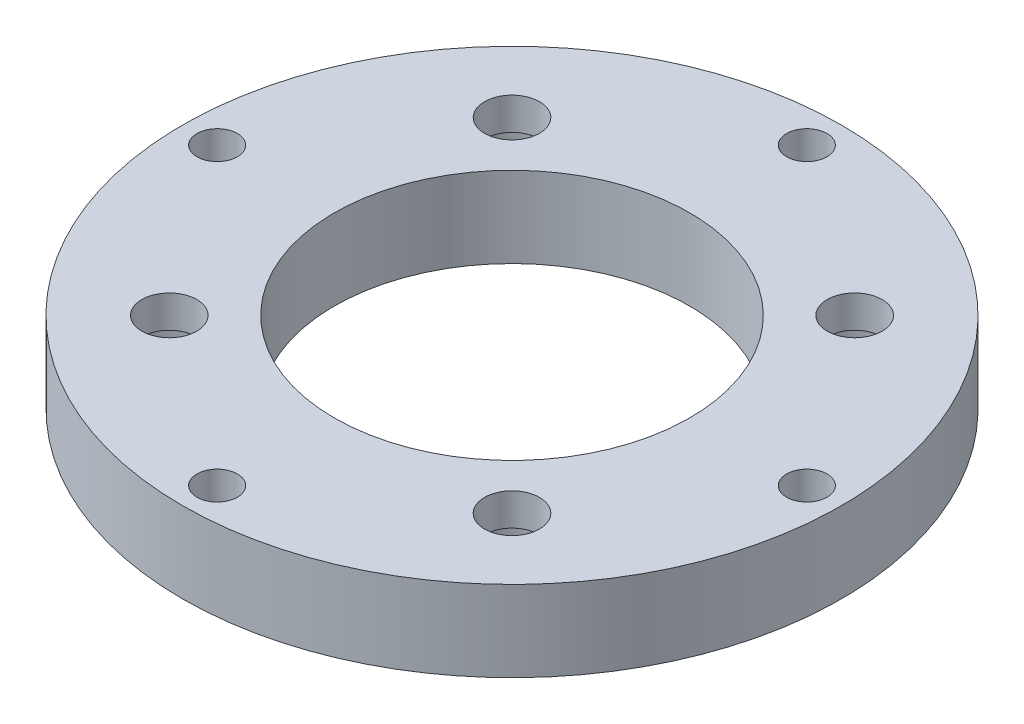
ISO-10303-21;
HEADER;
FILE_DESCRIPTION(('STEP AP214'),'2;1');
FILE_NAME('part.step','',(''),(''),'','','');
FILE_SCHEMA(('AUTOMOTIVE_DESIGN { 1 0 10303 214 1 1 1 1 }'));
ENDSEC;
DATA;
#1=APPLICATION_CONTEXT('core data for automotive mechanical design processes');
#2=APPLICATION_PROTOCOL_DEFINITION('international standard','automotive_design',2000,#1);
#3=PRODUCT_CONTEXT('',#1,'mechanical');
#4=PRODUCT('Part','Part','',(#3));
#5=PRODUCT_RELATED_PRODUCT_CATEGORY('part','',(#4));
#6=PRODUCT_DEFINITION_FORMATION('','',#4);
#7=PRODUCT_DEFINITION_CONTEXT('part definition',#1,'design');
#8=PRODUCT_DEFINITION('design','',#6,#7);
#9=PRODUCT_DEFINITION_SHAPE('','',#8);
#10=(LENGTH_UNIT() NAMED_UNIT(*) SI_UNIT(.MILLI.,.METRE.));
#11=(NAMED_UNIT(*) PLANE_ANGLE_UNIT() SI_UNIT($,.RADIAN.));
#12=(NAMED_UNIT(*) SI_UNIT($,.STERADIAN.) SOLID_ANGLE_UNIT());
#13=UNCERTAINTY_MEASURE_WITH_UNIT(LENGTH_MEASURE(1.E-05),#10,'distance_accuracy_value','');
#14=(GEOMETRIC_REPRESENTATION_CONTEXT(3) GLOBAL_UNCERTAINTY_ASSIGNED_CONTEXT((#13)) GLOBAL_UNIT_ASSIGNED_CONTEXT((#10,
#11,#12)) REPRESENTATION_CONTEXT('',''));
#15=CARTESIAN_POINT('',(0.,0.,0.));
#16=DIRECTION('',(0.,0.,1.));
#17=DIRECTION('',(1.,0.,0.));
#18=AXIS2_PLACEMENT_3D('',#15,#16,#17);
#19=CARTESIAN_POINT('',(0.,5.,0.));
#20=DIRECTION('',(0.,1.,0.));
#21=DIRECTION('',(0.,0.,1.));
#22=AXIS2_PLACEMENT_3D('',#19,#20,#21);
#23=PLANE('',#22);
#24=CARTESIAN_POINT('',(-10.6066017177982,5.,10.6066017177982));
#25=DIRECTION('',(0.,-1.,0.));
#26=DIRECTION('',(0.,0.,-1.));
#27=AXIS2_PLACEMENT_3D('',#24,#25,#26);
#28=CIRCLE('',#27,1.70000000000001);
#29=CARTESIAN_POINT('',(-10.6066017177982,5.,8.90660171779822));
#30=VERTEX_POINT('',#29);
#31=EDGE_CURVE('E114',#30,#30,#28,.T.);
#32=ORIENTED_EDGE('',*,*,#31,.T.);
#33=EDGE_LOOP('',(#32));
#34=FACE_BOUND('',#33,.T.);
#35=CARTESIAN_POINT('',(10.6066017177983,5.,10.6066017177982));
#36=DIRECTION('',(0.,-1.,0.));
#37=DIRECTION('',(0.,0.,-1.));
#38=AXIS2_PLACEMENT_3D('',#35,#36,#37);
#39=CIRCLE('',#38,1.70000000000001);
#40=CARTESIAN_POINT('',(10.6066017177983,5.,8.90660171779815));
#41=VERTEX_POINT('',#40);
#42=EDGE_CURVE('E102',#41,#41,#39,.T.);
#43=ORIENTED_EDGE('',*,*,#42,.T.);
#44=EDGE_LOOP('',(#43));
#45=FACE_BOUND('',#44,.T.);
#46=CARTESIAN_POINT('',(10.6066017177982,5.,-10.6066017177982));
#47=DIRECTION('',(0.,-1.,0.));
#48=DIRECTION('',(0.,0.,-1.));
#49=AXIS2_PLACEMENT_3D('',#46,#47,#48);
#50=CIRCLE('',#49,1.70000000000001);
#51=CARTESIAN_POINT('',(10.6066017177982,5.,-12.3066017177982));
#52=VERTEX_POINT('',#51);
#53=EDGE_CURVE('E90',#52,#52,#50,.T.);
#54=ORIENTED_EDGE('',*,*,#53,.T.);
#55=EDGE_LOOP('',(#54));
#56=FACE_BOUND('',#55,.T.);
#57=CARTESIAN_POINT('',(-10.6066017177983,5.,-10.6066017177981));
#58=DIRECTION('',(0.,-1.,0.));
#59=DIRECTION('',(0.,0.,-1.));
#60=AXIS2_PLACEMENT_3D('',#57,#58,#59);
#61=CIRCLE('',#60,1.70000000000001);
#62=CARTESIAN_POINT('',(-10.6066017177983,5.,-12.3066017177981));
#63=VERTEX_POINT('',#62);
#64=EDGE_CURVE('E78',#63,#63,#61,.T.);
#65=ORIENTED_EDGE('',*,*,#64,.T.);
#66=EDGE_LOOP('',(#65));
#67=FACE_BOUND('',#66,.T.);
#68=CARTESIAN_POINT('',(-18.25,5.,0.));
#69=DIRECTION('',(0.,1.,0.));
#70=DIRECTION('',(0.,0.,1.));
#71=AXIS2_PLACEMENT_3D('',#68,#69,#70);
#72=CIRCLE('',#71,1.24999999999999);
#73=CARTESIAN_POINT('',(-18.25,5.,1.24999999999999));
#74=VERTEX_POINT('',#73);
#75=EDGE_CURVE('E75',#74,#74,#72,.T.);
#76=ORIENTED_EDGE('',*,*,#75,.F.);
#77=EDGE_LOOP('',(#76));
#78=FACE_BOUND('',#77,.T.);
#79=CARTESIAN_POINT('',(0.,5.,-18.25));
#80=DIRECTION('',(0.,1.,0.));
#81=DIRECTION('',(0.,0.,1.));
#82=AXIS2_PLACEMENT_3D('',#79,#80,#81);
#83=CIRCLE('',#82,1.24999999999999);
#84=CARTESIAN_POINT('',(0.,5.,-17.));
#85=VERTEX_POINT('',#84);
#86=EDGE_CURVE('E69',#85,#85,#83,.T.);
#87=ORIENTED_EDGE('',*,*,#86,.F.);
#88=EDGE_LOOP('',(#87));
#89=FACE_BOUND('',#88,.T.);
#90=CARTESIAN_POINT('',(18.25,5.,0.));
#91=DIRECTION('',(0.,1.,0.));
#92=DIRECTION('',(0.,0.,1.));
#93=AXIS2_PLACEMENT_3D('',#90,#91,#92);
#94=CIRCLE('',#93,1.24999999999999);
#95=CARTESIAN_POINT('',(18.25,5.,1.24999999999999));
#96=VERTEX_POINT('',#95);
#97=EDGE_CURVE('E63',#96,#96,#94,.T.);
#98=ORIENTED_EDGE('',*,*,#97,.F.);
#99=EDGE_LOOP('',(#98));
#100=FACE_BOUND('',#99,.T.);
#101=CARTESIAN_POINT('',(0.,5.,18.25));
#102=DIRECTION('',(0.,1.,0.));
#103=DIRECTION('',(0.,0.,1.));
#104=AXIS2_PLACEMENT_3D('',#101,#102,#103);
#105=CIRCLE('',#104,1.24999999999999);
#106=CARTESIAN_POINT('',(0.,5.,19.5));
#107=VERTEX_POINT('',#106);
#108=EDGE_CURVE('E57',#107,#107,#105,.T.);
#109=ORIENTED_EDGE('',*,*,#108,.F.);
#110=EDGE_LOOP('',(#109));
#111=FACE_BOUND('',#110,.T.);
#112=CARTESIAN_POINT('',(0.,5.,0.));
#113=DIRECTION('',(0.,1.,0.));
#114=DIRECTION('',(0.,0.,1.));
#115=AXIS2_PLACEMENT_3D('',#112,#113,#114);
#116=CIRCLE('',#115,20.4);
#117=CARTESIAN_POINT('',(0.,5.,20.4));
#118=VERTEX_POINT('',#117);
#119=EDGE_CURVE('E10',#118,#118,#116,.T.);
#120=ORIENTED_EDGE('',*,*,#119,.T.);
#121=EDGE_LOOP('',(#120));
#122=FACE_BOUND('',#121,.T.);
#123=CARTESIAN_POINT('',(0.,5.,0.));
#124=DIRECTION('',(0.,1.,0.));
#125=DIRECTION('',(0.,0.,1.));
#126=AXIS2_PLACEMENT_3D('',#123,#124,#125);
#127=CIRCLE('',#126,11.);
#128=CARTESIAN_POINT('',(0.,5.,11.));
#129=VERTEX_POINT('',#128);
#130=EDGE_CURVE('E47',#129,#129,#127,.T.);
#131=ORIENTED_EDGE('',*,*,#130,.F.);
#132=EDGE_LOOP('',(#131));
#133=FACE_BOUND('',#132,.T.);
#134=ADVANCED_FACE('F36',(#34,#45,#56,#67,#78,#89,#100,#111,#122,#133),#23,.T.);
#135=CARTESIAN_POINT('',(0.,0.,0.));
#136=DIRECTION('',(0.,1.,0.));
#137=DIRECTION('',(0.,0.,1.));
#138=AXIS2_PLACEMENT_3D('',#135,#136,#137);
#139=PLANE('',#138);
#140=CARTESIAN_POINT('',(-10.6066017177982,0.,10.6066017177982));
#141=DIRECTION('',(0.,-1.,0.));
#142=DIRECTION('',(0.,0.,-1.));
#143=AXIS2_PLACEMENT_3D('',#140,#141,#142);
#144=CIRCLE('',#143,3.25);
#145=CARTESIAN_POINT('',(-10.6066017177982,0.,7.35660171779823));
#146=VERTEX_POINT('',#145);
#147=EDGE_CURVE('E123',#146,#146,#144,.T.);
#148=ORIENTED_EDGE('',*,*,#147,.F.);
#149=EDGE_LOOP('',(#148));
#150=FACE_BOUND('',#149,.T.);
#151=CARTESIAN_POINT('',(10.6066017177983,0.,10.6066017177982));
#152=DIRECTION('',(0.,-1.,0.));
#153=DIRECTION('',(0.,0.,-1.));
#154=AXIS2_PLACEMENT_3D('',#151,#152,#153);
#155=CIRCLE('',#154,3.25);
#156=CARTESIAN_POINT('',(10.6066017177983,0.,7.35660171779816));
#157=VERTEX_POINT('',#156);
#158=EDGE_CURVE('E111',#157,#157,#155,.T.);
#159=ORIENTED_EDGE('',*,*,#158,.F.);
#160=EDGE_LOOP('',(#159));
#161=FACE_BOUND('',#160,.T.);
#162=CARTESIAN_POINT('',(10.6066017177982,0.,-10.6066017177982));
#163=DIRECTION('',(0.,-1.,0.));
#164=DIRECTION('',(0.,0.,-1.));
#165=AXIS2_PLACEMENT_3D('',#162,#163,#164);
#166=CIRCLE('',#165,3.25);
#167=CARTESIAN_POINT('',(10.6066017177982,0.,-13.8566017177982));
#168=VERTEX_POINT('',#167);
#169=EDGE_CURVE('E99',#168,#168,#166,.T.);
#170=ORIENTED_EDGE('',*,*,#169,.F.);
#171=EDGE_LOOP('',(#170));
#172=FACE_BOUND('',#171,.T.);
#173=CARTESIAN_POINT('',(-10.6066017177983,0.,-10.6066017177981));
#174=DIRECTION('',(0.,-1.,0.));
#175=DIRECTION('',(0.,0.,-1.));
#176=AXIS2_PLACEMENT_3D('',#173,#174,#175);
#177=CIRCLE('',#176,3.25);
#178=CARTESIAN_POINT('',(-10.6066017177983,0.,-13.8566017177981));
#179=VERTEX_POINT('',#178);
#180=EDGE_CURVE('E87',#179,#179,#177,.T.);
#181=ORIENTED_EDGE('',*,*,#180,.F.);
#182=EDGE_LOOP('',(#181));
#183=FACE_BOUND('',#182,.T.);
#184=CARTESIAN_POINT('',(-18.25,0.,0.));
#185=DIRECTION('',(0.,1.,0.));
#186=DIRECTION('',(0.,0.,1.));
#187=AXIS2_PLACEMENT_3D('',#184,#185,#186);
#188=CIRCLE('',#187,1.25);
#189=CARTESIAN_POINT('',(-18.25,0.,1.25));
#190=VERTEX_POINT('',#189);
#191=EDGE_CURVE('E72',#190,#190,#188,.T.);
#192=ORIENTED_EDGE('',*,*,#191,.T.);
#193=EDGE_LOOP('',(#192));
#194=FACE_BOUND('',#193,.T.);
#195=CARTESIAN_POINT('',(0.,0.,-18.25));
#196=DIRECTION('',(0.,1.,0.));
#197=DIRECTION('',(0.,0.,1.));
#198=AXIS2_PLACEMENT_3D('',#195,#196,#197);
#199=CIRCLE('',#198,1.25);
#200=CARTESIAN_POINT('',(0.,0.,-17.));
#201=VERTEX_POINT('',#200);
#202=EDGE_CURVE('E66',#201,#201,#199,.T.);
#203=ORIENTED_EDGE('',*,*,#202,.T.);
#204=EDGE_LOOP('',(#203));
#205=FACE_BOUND('',#204,.T.);
#206=CARTESIAN_POINT('',(18.25,0.,0.));
#207=DIRECTION('',(0.,1.,0.));
#208=DIRECTION('',(0.,0.,1.));
#209=AXIS2_PLACEMENT_3D('',#206,#207,#208);
#210=CIRCLE('',#209,1.25);
#211=CARTESIAN_POINT('',(18.25,0.,1.25));
#212=VERTEX_POINT('',#211);
#213=EDGE_CURVE('E60',#212,#212,#210,.T.);
#214=ORIENTED_EDGE('',*,*,#213,.T.);
#215=EDGE_LOOP('',(#214));
#216=FACE_BOUND('',#215,.T.);
#217=CARTESIAN_POINT('',(0.,0.,18.25));
#218=DIRECTION('',(0.,1.,0.));
#219=DIRECTION('',(0.,0.,1.));
#220=AXIS2_PLACEMENT_3D('',#217,#218,#219);
#221=CIRCLE('',#220,1.25);
#222=CARTESIAN_POINT('',(0.,0.,19.5));
#223=VERTEX_POINT('',#222);
#224=EDGE_CURVE('E52',#223,#223,#221,.T.);
#225=ORIENTED_EDGE('',*,*,#224,.T.);
#226=EDGE_LOOP('',(#225));
#227=FACE_BOUND('',#226,.T.);
#228=CARTESIAN_POINT('',(0.,0.,0.));
#229=DIRECTION('',(0.,1.,0.));
#230=DIRECTION('',(0.,0.,1.));
#231=AXIS2_PLACEMENT_3D('',#228,#229,#230);
#232=CIRCLE('',#231,20.4);
#233=CARTESIAN_POINT('',(0.,0.,20.4));
#234=VERTEX_POINT('',#233);
#235=EDGE_CURVE('E40',#234,#234,#232,.T.);
#236=ORIENTED_EDGE('',*,*,#235,.F.);
#237=EDGE_LOOP('',(#236));
#238=FACE_BOUND('',#237,.T.);
#239=CARTESIAN_POINT('',(0.,0.,0.));
#240=DIRECTION('',(0.,1.,0.));
#241=DIRECTION('',(0.,0.,1.));
#242=AXIS2_PLACEMENT_3D('',#239,#240,#241);
#243=CIRCLE('',#242,11.);
#244=CARTESIAN_POINT('',(0.,0.,11.));
#245=VERTEX_POINT('',#244);
#246=EDGE_CURVE('E49',#245,#245,#243,.T.);
#247=ORIENTED_EDGE('',*,*,#246,.T.);
#248=EDGE_LOOP('',(#247));
#249=FACE_BOUND('',#248,.T.);
#250=ADVANCED_FACE('F129',(#150,#161,#172,#183,#194,#205,#216,#227,#238,#249),#139,.F.);
#251=CARTESIAN_POINT('',(0.,5.,0.));
#252=DIRECTION('',(0.,-1.,0.));
#253=DIRECTION('',(0.,0.,-1.));
#254=AXIS2_PLACEMENT_3D('',#251,#252,#253);
#255=CYLINDRICAL_SURFACE('',#254,20.4);
#256=ORIENTED_EDGE('',*,*,#119,.F.);
#257=EDGE_LOOP('',(#256));
#258=FACE_BOUND('',#257,.T.);
#259=ORIENTED_EDGE('',*,*,#235,.T.);
#260=EDGE_LOOP('',(#259));
#261=FACE_BOUND('',#260,.T.);
#262=ADVANCED_FACE('F38',(#258,#261),#255,.T.);
#263=CARTESIAN_POINT('',(0.,5.,0.));
#264=DIRECTION('',(0.,-1.,0.));
#265=DIRECTION('',(0.,0.,-1.));
#266=AXIS2_PLACEMENT_3D('',#263,#264,#265);
#267=CYLINDRICAL_SURFACE('',#266,11.);
#268=ORIENTED_EDGE('',*,*,#130,.T.);
#269=EDGE_LOOP('',(#268));
#270=FACE_BOUND('',#269,.T.);
#271=ORIENTED_EDGE('',*,*,#246,.F.);
#272=EDGE_LOOP('',(#271));
#273=FACE_BOUND('',#272,.T.);
#274=ADVANCED_FACE('F150',(#270,#273),#267,.F.);
#275=CARTESIAN_POINT('',(0.,5.,18.25));
#276=DIRECTION('',(0.,1.,0.));
#277=DIRECTION('',(0.,0.,1.));
#278=AXIS2_PLACEMENT_3D('',#275,#276,#277);
#279=CYLINDRICAL_SURFACE('',#278,1.24999999999999);
#280=ORIENTED_EDGE('',*,*,#224,.F.);
#281=EDGE_LOOP('',(#280));
#282=FACE_BOUND('',#281,.T.);
#283=ORIENTED_EDGE('',*,*,#108,.T.);
#284=EDGE_LOOP('',(#283));
#285=FACE_BOUND('',#284,.T.);
#286=ADVANCED_FACE('F152',(#282,#285),#279,.F.);
#287=CARTESIAN_POINT('',(18.25,5.,0.));
#288=DIRECTION('',(0.,1.,0.));
#289=DIRECTION('',(0.,0.,1.));
#290=AXIS2_PLACEMENT_3D('',#287,#288,#289);
#291=CYLINDRICAL_SURFACE('',#290,1.24999999999999);
#292=ORIENTED_EDGE('',*,*,#213,.F.);
#293=EDGE_LOOP('',(#292));
#294=FACE_BOUND('',#293,.T.);
#295=ORIENTED_EDGE('',*,*,#97,.T.);
#296=EDGE_LOOP('',(#295));
#297=FACE_BOUND('',#296,.T.);
#298=ADVANCED_FACE('F159',(#294,#297),#291,.F.);
#299=CARTESIAN_POINT('',(0.,5.,-18.25));
#300=DIRECTION('',(0.,1.,0.));
#301=DIRECTION('',(0.,0.,1.));
#302=AXIS2_PLACEMENT_3D('',#299,#300,#301);
#303=CYLINDRICAL_SURFACE('',#302,1.24999999999999);
#304=ORIENTED_EDGE('',*,*,#202,.F.);
#305=EDGE_LOOP('',(#304));
#306=FACE_BOUND('',#305,.T.);
#307=ORIENTED_EDGE('',*,*,#86,.T.);
#308=EDGE_LOOP('',(#307));
#309=FACE_BOUND('',#308,.T.);
#310=ADVANCED_FACE('F188',(#306,#309),#303,.F.);
#311=CARTESIAN_POINT('',(-18.25,5.,0.));
#312=DIRECTION('',(0.,1.,0.));
#313=DIRECTION('',(0.,0.,1.));
#314=AXIS2_PLACEMENT_3D('',#311,#312,#313);
#315=CYLINDRICAL_SURFACE('',#314,1.24999999999999);
#316=ORIENTED_EDGE('',*,*,#191,.F.);
#317=EDGE_LOOP('',(#316));
#318=FACE_BOUND('',#317,.T.);
#319=ORIENTED_EDGE('',*,*,#75,.T.);
#320=EDGE_LOOP('',(#319));
#321=FACE_BOUND('',#320,.T.);
#322=ADVANCED_FACE('F194',(#318,#321),#315,.F.);
#323=CARTESIAN_POINT('',(-10.6066017177983,0.,-10.6066017177981));
#324=DIRECTION('',(0.,-1.,0.));
#325=DIRECTION('',(0.,0.,-1.));
#326=AXIS2_PLACEMENT_3D('',#323,#324,#325);
#327=CYLINDRICAL_SURFACE('',#326,1.70000000000001);
#328=ORIENTED_EDGE('',*,*,#64,.F.);
#329=EDGE_LOOP('',(#328));
#330=FACE_BOUND('',#329,.T.);
#331=CARTESIAN_POINT('',(-10.6066017177983,3.,-10.6066017177981));
#332=DIRECTION('',(0.,-1.,0.));
#333=DIRECTION('',(0.,0.,-1.));
#334=AXIS2_PLACEMENT_3D('',#331,#332,#333);
#335=CIRCLE('',#334,1.70000000000001);
#336=CARTESIAN_POINT('',(-10.6066017177983,3.,-12.3066017177981));
#337=VERTEX_POINT('',#336);
#338=EDGE_CURVE('E81',#337,#337,#335,.T.);
#339=ORIENTED_EDGE('',*,*,#338,.T.);
#340=EDGE_LOOP('',(#339));
#341=FACE_BOUND('',#340,.T.);
#342=ADVANCED_FACE('F200',(#330,#341),#327,.F.);
#343=CARTESIAN_POINT('',(-8.90660171779833,3.,-10.6066017177981));
#344=DIRECTION('',(0.,1.,0.));
#345=DIRECTION('',(0.,0.,1.));
#346=AXIS2_PLACEMENT_3D('',#343,#344,#345);
#347=PLANE('',#346);
#348=ORIENTED_EDGE('',*,*,#338,.F.);
#349=EDGE_LOOP('',(#348));
#350=FACE_BOUND('',#349,.T.);
#351=CARTESIAN_POINT('',(-10.6066017177983,3.,-10.6066017177981));
#352=DIRECTION('',(0.,-1.,0.));
#353=DIRECTION('',(0.,0.,-1.));
#354=AXIS2_PLACEMENT_3D('',#351,#352,#353);
#355=CIRCLE('',#354,3.25);
#356=CARTESIAN_POINT('',(-10.6066017177983,3.,-13.8566017177981));
#357=VERTEX_POINT('',#356);
#358=EDGE_CURVE('E84',#357,#357,#355,.T.);
#359=ORIENTED_EDGE('',*,*,#358,.T.);
#360=EDGE_LOOP('',(#359));
#361=FACE_BOUND('',#360,.T.);
#362=ADVANCED_FACE('F204',(#350,#361),#347,.F.);
#363=CARTESIAN_POINT('',(-10.6066017177983,0.,-10.6066017177981));
#364=DIRECTION('',(0.,-1.,0.));
#365=DIRECTION('',(0.,0.,-1.));
#366=AXIS2_PLACEMENT_3D('',#363,#364,#365);
#367=CYLINDRICAL_SURFACE('',#366,3.25);
#368=ORIENTED_EDGE('',*,*,#358,.F.);
#369=EDGE_LOOP('',(#368));
#370=FACE_BOUND('',#369,.T.);
#371=ORIENTED_EDGE('',*,*,#180,.T.);
#372=EDGE_LOOP('',(#371));
#373=FACE_BOUND('',#372,.T.);
#374=ADVANCED_FACE('F208',(#370,#373),#367,.F.);
#375=CARTESIAN_POINT('',(10.6066017177982,0.,-10.6066017177982));
#376=DIRECTION('',(0.,-1.,0.));
#377=DIRECTION('',(0.,0.,-1.));
#378=AXIS2_PLACEMENT_3D('',#375,#376,#377);
#379=CYLINDRICAL_SURFACE('',#378,1.70000000000001);
#380=ORIENTED_EDGE('',*,*,#53,.F.);
#381=EDGE_LOOP('',(#380));
#382=FACE_BOUND('',#381,.T.);
#383=CARTESIAN_POINT('',(10.6066017177982,3.,-10.6066017177982));
#384=DIRECTION('',(0.,-1.,0.));
#385=DIRECTION('',(0.,0.,-1.));
#386=AXIS2_PLACEMENT_3D('',#383,#384,#385);
#387=CIRCLE('',#386,1.70000000000001);
#388=CARTESIAN_POINT('',(10.6066017177982,3.,-12.3066017177982));
#389=VERTEX_POINT('',#388);
#390=EDGE_CURVE('E93',#389,#389,#387,.T.);
#391=ORIENTED_EDGE('',*,*,#390,.T.);
#392=EDGE_LOOP('',(#391));
#393=FACE_BOUND('',#392,.T.);
#394=ADVANCED_FACE('F212',(#382,#393),#379,.F.);
#395=CARTESIAN_POINT('',(12.3066017177982,3.,-10.6066017177982));
#396=DIRECTION('',(0.,1.,0.));
#397=DIRECTION('',(0.,0.,1.));
#398=AXIS2_PLACEMENT_3D('',#395,#396,#397);
#399=PLANE('',#398);
#400=ORIENTED_EDGE('',*,*,#390,.F.);
#401=EDGE_LOOP('',(#400));
#402=FACE_BOUND('',#401,.T.);
#403=CARTESIAN_POINT('',(10.6066017177982,3.,-10.6066017177982));
#404=DIRECTION('',(0.,-1.,0.));
#405=DIRECTION('',(0.,0.,-1.));
#406=AXIS2_PLACEMENT_3D('',#403,#404,#405);
#407=CIRCLE('',#406,3.25);
#408=CARTESIAN_POINT('',(10.6066017177982,3.,-13.8566017177982));
#409=VERTEX_POINT('',#408);
#410=EDGE_CURVE('E96',#409,#409,#407,.T.);
#411=ORIENTED_EDGE('',*,*,#410,.T.);
#412=EDGE_LOOP('',(#411));
#413=FACE_BOUND('',#412,.T.);
#414=ADVANCED_FACE('F216',(#402,#413),#399,.F.);
#415=CARTESIAN_POINT('',(10.6066017177982,0.,-10.6066017177982));
#416=DIRECTION('',(0.,-1.,0.));
#417=DIRECTION('',(0.,0.,-1.));
#418=AXIS2_PLACEMENT_3D('',#415,#416,#417);
#419=CYLINDRICAL_SURFACE('',#418,3.25);
#420=ORIENTED_EDGE('',*,*,#410,.F.);
#421=EDGE_LOOP('',(#420));
#422=FACE_BOUND('',#421,.T.);
#423=ORIENTED_EDGE('',*,*,#169,.T.);
#424=EDGE_LOOP('',(#423));
#425=FACE_BOUND('',#424,.T.);
#426=ADVANCED_FACE('F220',(#422,#425),#419,.F.);
#427=CARTESIAN_POINT('',(10.6066017177983,0.,10.6066017177982));
#428=DIRECTION('',(0.,-1.,0.));
#429=DIRECTION('',(0.,0.,-1.));
#430=AXIS2_PLACEMENT_3D('',#427,#428,#429);
#431=CYLINDRICAL_SURFACE('',#430,1.70000000000001);
#432=ORIENTED_EDGE('',*,*,#42,.F.);
#433=EDGE_LOOP('',(#432));
#434=FACE_BOUND('',#433,.T.);
#435=CARTESIAN_POINT('',(10.6066017177983,3.,10.6066017177982));
#436=DIRECTION('',(0.,-1.,0.));
#437=DIRECTION('',(0.,0.,-1.));
#438=AXIS2_PLACEMENT_3D('',#435,#436,#437);
#439=CIRCLE('',#438,1.70000000000001);
#440=CARTESIAN_POINT('',(10.6066017177983,3.,8.90660171779815));
#441=VERTEX_POINT('',#440);
#442=EDGE_CURVE('E105',#441,#441,#439,.T.);
#443=ORIENTED_EDGE('',*,*,#442,.T.);
#444=EDGE_LOOP('',(#443));
#445=FACE_BOUND('',#444,.T.);
#446=ADVANCED_FACE('F224',(#434,#445),#431,.F.);
#447=CARTESIAN_POINT('',(12.3066017177983,3.,10.6066017177982));
#448=DIRECTION('',(0.,1.,0.));
#449=DIRECTION('',(0.,0.,1.));
#450=AXIS2_PLACEMENT_3D('',#447,#448,#449);
#451=PLANE('',#450);
#452=ORIENTED_EDGE('',*,*,#442,.F.);
#453=EDGE_LOOP('',(#452));
#454=FACE_BOUND('',#453,.T.);
#455=CARTESIAN_POINT('',(10.6066017177983,3.,10.6066017177982));
#456=DIRECTION('',(0.,-1.,0.));
#457=DIRECTION('',(0.,0.,-1.));
#458=AXIS2_PLACEMENT_3D('',#455,#456,#457);
#459=CIRCLE('',#458,3.25);
#460=CARTESIAN_POINT('',(10.6066017177983,3.,7.35660171779816));
#461=VERTEX_POINT('',#460);
#462=EDGE_CURVE('E108',#461,#461,#459,.T.);
#463=ORIENTED_EDGE('',*,*,#462,.T.);
#464=EDGE_LOOP('',(#463));
#465=FACE_BOUND('',#464,.T.);
#466=ADVANCED_FACE('F228',(#454,#465),#451,.F.);
#467=CARTESIAN_POINT('',(10.6066017177983,0.,10.6066017177982));
#468=DIRECTION('',(0.,-1.,0.));
#469=DIRECTION('',(0.,0.,-1.));
#470=AXIS2_PLACEMENT_3D('',#467,#468,#469);
#471=CYLINDRICAL_SURFACE('',#470,3.25);
#472=ORIENTED_EDGE('',*,*,#462,.F.);
#473=EDGE_LOOP('',(#472));
#474=FACE_BOUND('',#473,.T.);
#475=ORIENTED_EDGE('',*,*,#158,.T.);
#476=EDGE_LOOP('',(#475));
#477=FACE_BOUND('',#476,.T.);
#478=ADVANCED_FACE('F232',(#474,#477),#471,.F.);
#479=CARTESIAN_POINT('',(-10.6066017177982,0.,10.6066017177982));
#480=DIRECTION('',(0.,-1.,0.));
#481=DIRECTION('',(0.,0.,-1.));
#482=AXIS2_PLACEMENT_3D('',#479,#480,#481);
#483=CYLINDRICAL_SURFACE('',#482,1.70000000000001);
#484=ORIENTED_EDGE('',*,*,#31,.F.);
#485=EDGE_LOOP('',(#484));
#486=FACE_BOUND('',#485,.T.);
#487=CARTESIAN_POINT('',(-10.6066017177982,3.,10.6066017177982));
#488=DIRECTION('',(0.,-1.,0.));
#489=DIRECTION('',(0.,0.,-1.));
#490=AXIS2_PLACEMENT_3D('',#487,#488,#489);
#491=CIRCLE('',#490,1.70000000000001);
#492=CARTESIAN_POINT('',(-10.6066017177982,3.,8.90660171779822));
#493=VERTEX_POINT('',#492);
#494=EDGE_CURVE('E117',#493,#493,#491,.T.);
#495=ORIENTED_EDGE('',*,*,#494,.T.);
#496=EDGE_LOOP('',(#495));
#497=FACE_BOUND('',#496,.T.);
#498=ADVANCED_FACE('F236',(#486,#497),#483,.F.);
#499=CARTESIAN_POINT('',(-8.90660171779819,3.,10.6066017177982));
#500=DIRECTION('',(0.,1.,0.));
#501=DIRECTION('',(0.,0.,1.));
#502=AXIS2_PLACEMENT_3D('',#499,#500,#501);
#503=PLANE('',#502);
#504=ORIENTED_EDGE('',*,*,#494,.F.);
#505=EDGE_LOOP('',(#504));
#506=FACE_BOUND('',#505,.T.);
#507=CARTESIAN_POINT('',(-10.6066017177982,3.,10.6066017177982));
#508=DIRECTION('',(0.,-1.,0.));
#509=DIRECTION('',(0.,0.,-1.));
#510=AXIS2_PLACEMENT_3D('',#507,#508,#509);
#511=CIRCLE('',#510,3.25);
#512=CARTESIAN_POINT('',(-10.6066017177982,3.,7.35660171779823));
#513=VERTEX_POINT('',#512);
#514=EDGE_CURVE('E120',#513,#513,#511,.T.);
#515=ORIENTED_EDGE('',*,*,#514,.T.);
#516=EDGE_LOOP('',(#515));
#517=FACE_BOUND('',#516,.T.);
#518=ADVANCED_FACE('F240',(#506,#517),#503,.F.);
#519=CARTESIAN_POINT('',(-10.6066017177982,0.,10.6066017177982));
#520=DIRECTION('',(0.,-1.,0.));
#521=DIRECTION('',(0.,0.,-1.));
#522=AXIS2_PLACEMENT_3D('',#519,#520,#521);
#523=CYLINDRICAL_SURFACE('',#522,3.25);
#524=ORIENTED_EDGE('',*,*,#514,.F.);
#525=EDGE_LOOP('',(#524));
#526=FACE_BOUND('',#525,.T.);
#527=ORIENTED_EDGE('',*,*,#147,.T.);
#528=EDGE_LOOP('',(#527));
#529=FACE_BOUND('',#528,.T.);
#530=ADVANCED_FACE('F127',(#526,#529),#523,.F.);
#531=CLOSED_SHELL('',(#134,#250,#262,#274,#286,#298,#310,#322,#342,#362,#374,#394,#414,#426,
#446,#466,#478,#498,#518,#530));
#532=MANIFOLD_SOLID_BREP('B2',#531);
#533=ADVANCED_BREP_SHAPE_REPRESENTATION('',(#18,#532),#14);
#534=SHAPE_DEFINITION_REPRESENTATION(#9,#533);
ENDSEC;
END-ISO-10303-21;
